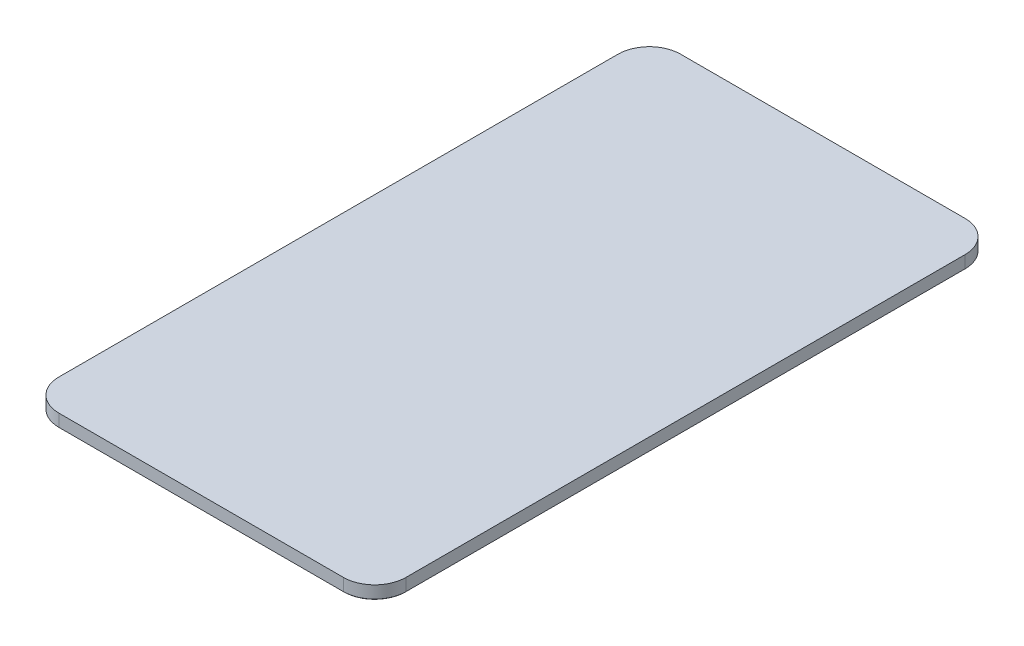
ISO-10303-21;
HEADER;
FILE_DESCRIPTION(('STEP AP214'),'2;1');
FILE_NAME('part.step','',(''),(''),'','','');
FILE_SCHEMA(('AUTOMOTIVE_DESIGN { 1 0 10303 214 1 1 1 1 }'));
ENDSEC;
DATA;
#1=APPLICATION_CONTEXT('core data for automotive mechanical design processes');
#2=APPLICATION_PROTOCOL_DEFINITION('international standard','automotive_design',2000,#1);
#3=PRODUCT_CONTEXT('',#1,'mechanical');
#4=PRODUCT('Part','Part','',(#3));
#5=PRODUCT_RELATED_PRODUCT_CATEGORY('part','',(#4));
#6=PRODUCT_DEFINITION_FORMATION('','',#4);
#7=PRODUCT_DEFINITION_CONTEXT('part definition',#1,'design');
#8=PRODUCT_DEFINITION('design','',#6,#7);
#9=PRODUCT_DEFINITION_SHAPE('','',#8);
#10=(LENGTH_UNIT() NAMED_UNIT(*) SI_UNIT(.MILLI.,.METRE.));
#11=(NAMED_UNIT(*) PLANE_ANGLE_UNIT() SI_UNIT($,.RADIAN.));
#12=(NAMED_UNIT(*) SI_UNIT($,.STERADIAN.) SOLID_ANGLE_UNIT());
#13=UNCERTAINTY_MEASURE_WITH_UNIT(LENGTH_MEASURE(1.E-05),#10,'distance_accuracy_value','');
#14=(GEOMETRIC_REPRESENTATION_CONTEXT(3) GLOBAL_UNCERTAINTY_ASSIGNED_CONTEXT((#13)) GLOBAL_UNIT_ASSIGNED_CONTEXT((#10,
#11,#12)) REPRESENTATION_CONTEXT('',''));
#15=CARTESIAN_POINT('',(0.,0.,0.));
#16=DIRECTION('',(0.,0.,1.));
#17=DIRECTION('',(1.,0.,0.));
#18=AXIS2_PLACEMENT_3D('',#15,#16,#17);
#19=CARTESIAN_POINT('',(0.,5.969,0.));
#20=DIRECTION('',(1.,0.,0.));
#21=DIRECTION('',(0.,0.,-1.));
#22=AXIS2_PLACEMENT_3D('',#19,#20,#21);
#23=PLANE('',#22);
#24=DIRECTION('',(0.,-1.,0.));
#25=VECTOR('',#24,1.);
#26=CARTESIAN_POINT('',(0.,5.969,-273.05));
#27=LINE('',#26,#25);
#28=CARTESIAN_POINT('',(0.,5.969,-273.05));
#29=VERTEX_POINT('',#28);
#30=CARTESIAN_POINT('',(0.,0.254000000000004,-273.05));
#31=VERTEX_POINT('',#30);
#32=EDGE_CURVE('E160',#29,#31,#27,.T.);
#33=ORIENTED_EDGE('',*,*,#32,.T.);
#34=DIRECTION('',(0.,0.,1.));
#35=VECTOR('',#34,1.);
#36=CARTESIAN_POINT('',(0.,0.254000000000004,-14.478));
#37=LINE('',#36,#35);
#38=CARTESIAN_POINT('',(0.,0.254000000000004,-14.478));
#39=VERTEX_POINT('',#38);
#40=EDGE_CURVE('E189',#31,#39,#37,.T.);
#41=ORIENTED_EDGE('',*,*,#40,.T.);
#42=DIRECTION('',(0.,-1.,0.));
#43=VECTOR('',#42,1.);
#44=CARTESIAN_POINT('',(0.,5.969,-14.478));
#45=LINE('',#44,#43);
#46=CARTESIAN_POINT('',(0.,5.969,-14.478));
#47=VERTEX_POINT('',#46);
#48=EDGE_CURVE('E163',#39,#47,#45,.F.);
#49=ORIENTED_EDGE('',*,*,#48,.T.);
#50=DIRECTION('',(0.,0.,1.));
#51=VECTOR('',#50,1.);
#52=CARTESIAN_POINT('',(0.,5.969,0.));
#53=LINE('',#52,#51);
#54=EDGE_CURVE('E218',#29,#47,#53,.T.);
#55=ORIENTED_EDGE('',*,*,#54,.F.);
#56=EDGE_LOOP('',(#33,#41,#49,#55));
#57=FACE_BOUND('',#56,.T.);
#58=ADVANCED_FACE('F35',(#57),#23,.F.);
#59=CARTESIAN_POINT('',(0.,5.969,0.));
#60=DIRECTION('',(0.,0.,-1.));
#61=DIRECTION('',(-1.,0.,0.));
#62=AXIS2_PLACEMENT_3D('',#59,#60,#61);
#63=PLANE('',#62);
#64=DIRECTION('',(0.,-1.,0.));
#65=VECTOR('',#64,1.);
#66=CARTESIAN_POINT('',(14.478,5.969,0.));
#67=LINE('',#66,#65);
#68=CARTESIAN_POINT('',(14.478,5.969,0.));
#69=VERTEX_POINT('',#68);
#70=CARTESIAN_POINT('',(14.478,0.254000000000004,0.));
#71=VERTEX_POINT('',#70);
#72=EDGE_CURVE('E133',#69,#71,#67,.T.);
#73=ORIENTED_EDGE('',*,*,#72,.T.);
#74=DIRECTION('',(1.,0.,0.));
#75=VECTOR('',#74,1.);
#76=CARTESIAN_POINT('',(146.05,0.254000000000004,0.));
#77=LINE('',#76,#75);
#78=CARTESIAN_POINT('',(146.05,0.254000000000004,0.));
#79=VERTEX_POINT('',#78);
#80=EDGE_CURVE('E185',#71,#79,#77,.T.);
#81=ORIENTED_EDGE('',*,*,#80,.T.);
#82=DIRECTION('',(0.,-1.,0.));
#83=VECTOR('',#82,1.);
#84=CARTESIAN_POINT('',(146.05,5.969,0.));
#85=LINE('',#84,#83);
#86=CARTESIAN_POINT('',(146.05,5.969,0.));
#87=VERTEX_POINT('',#86);
#88=EDGE_CURVE('E158',#79,#87,#85,.F.);
#89=ORIENTED_EDGE('',*,*,#88,.T.);
#90=DIRECTION('',(1.,0.,0.));
#91=VECTOR('',#90,1.);
#92=CARTESIAN_POINT('',(0.,5.969,0.));
#93=LINE('',#92,#91);
#94=EDGE_CURVE('E223',#69,#87,#93,.T.);
#95=ORIENTED_EDGE('',*,*,#94,.F.);
#96=EDGE_LOOP('',(#73,#81,#89,#95));
#97=FACE_BOUND('',#96,.T.);
#98=ADVANCED_FACE('F267',(#97),#63,.F.);
#99=CARTESIAN_POINT('',(160.528,5.969,0.));
#100=DIRECTION('',(-1.,0.,0.));
#101=DIRECTION('',(0.,0.,1.));
#102=AXIS2_PLACEMENT_3D('',#99,#100,#101);
#103=PLANE('',#102);
#104=DIRECTION('',(0.,-1.,0.));
#105=VECTOR('',#104,1.);
#106=CARTESIAN_POINT('',(160.528,5.969,-14.478));
#107=LINE('',#106,#105);
#108=CARTESIAN_POINT('',(160.528,5.969,-14.478));
#109=VERTEX_POINT('',#108);
#110=CARTESIAN_POINT('',(160.528,0.254000000000004,-14.478));
#111=VERTEX_POINT('',#110);
#112=EDGE_CURVE('E144',#109,#111,#107,.T.);
#113=ORIENTED_EDGE('',*,*,#112,.T.);
#114=DIRECTION('',(0.,0.,-1.));
#115=VECTOR('',#114,1.);
#116=CARTESIAN_POINT('',(160.528,0.254000000000004,-273.05));
#117=LINE('',#116,#115);
#118=CARTESIAN_POINT('',(160.528,0.254000000000004,-273.05));
#119=VERTEX_POINT('',#118);
#120=EDGE_CURVE('E11',#111,#119,#117,.T.);
#121=ORIENTED_EDGE('',*,*,#120,.T.);
#122=DIRECTION('',(0.,-1.,0.));
#123=VECTOR('',#122,1.);
#124=CARTESIAN_POINT('',(160.528,5.969,-273.05));
#125=LINE('',#124,#123);
#126=CARTESIAN_POINT('',(160.528,5.969,-273.05));
#127=VERTEX_POINT('',#126);
#128=EDGE_CURVE('E146',#119,#127,#125,.F.);
#129=ORIENTED_EDGE('',*,*,#128,.T.);
#130=DIRECTION('',(0.,0.,-1.));
#131=VECTOR('',#130,1.);
#132=CARTESIAN_POINT('',(160.528,5.969,0.));
#133=LINE('',#132,#131);
#134=EDGE_CURVE('E132',#109,#127,#133,.T.);
#135=ORIENTED_EDGE('',*,*,#134,.F.);
#136=EDGE_LOOP('',(#113,#121,#129,#135));
#137=FACE_BOUND('',#136,.T.);
#138=ADVANCED_FACE('F239',(#137),#103,.F.);
#139=CARTESIAN_POINT('',(0.,5.969,-287.528));
#140=DIRECTION('',(0.,0.,1.));
#141=DIRECTION('',(1.,0.,0.));
#142=AXIS2_PLACEMENT_3D('',#139,#140,#141);
#143=PLANE('',#142);
#144=DIRECTION('',(0.,-1.,0.));
#145=VECTOR('',#144,1.);
#146=CARTESIAN_POINT('',(146.05,5.969,-287.528));
#147=LINE('',#146,#145);
#148=CARTESIAN_POINT('',(146.05,5.969,-287.528));
#149=VERTEX_POINT('',#148);
#150=CARTESIAN_POINT('',(146.05,0.254000000000004,-287.528));
#151=VERTEX_POINT('',#150);
#152=EDGE_CURVE('E138',#149,#151,#147,.T.);
#153=ORIENTED_EDGE('',*,*,#152,.T.);
#154=DIRECTION('',(-1.,0.,0.));
#155=VECTOR('',#154,1.);
#156=CARTESIAN_POINT('',(14.478,0.254000000000004,-287.528));
#157=LINE('',#156,#155);
#158=CARTESIAN_POINT('',(14.478,0.254000000000004,-287.528));
#159=VERTEX_POINT('',#158);
#160=EDGE_CURVE('E193',#151,#159,#157,.T.);
#161=ORIENTED_EDGE('',*,*,#160,.T.);
#162=DIRECTION('',(0.,-1.,0.));
#163=VECTOR('',#162,1.);
#164=CARTESIAN_POINT('',(14.478,5.969,-287.528));
#165=LINE('',#164,#163);
#166=CARTESIAN_POINT('',(14.478,5.969,-287.528));
#167=VERTEX_POINT('',#166);
#168=EDGE_CURVE('E141',#159,#167,#165,.F.);
#169=ORIENTED_EDGE('',*,*,#168,.T.);
#170=DIRECTION('',(-1.,0.,0.));
#171=VECTOR('',#170,1.);
#172=CARTESIAN_POINT('',(0.,5.969,-287.528));
#173=LINE('',#172,#171);
#174=EDGE_CURVE('E129',#149,#167,#173,.T.);
#175=ORIENTED_EDGE('',*,*,#174,.F.);
#176=EDGE_LOOP('',(#153,#161,#169,#175));
#177=FACE_BOUND('',#176,.T.);
#178=ADVANCED_FACE('F137',(#177),#143,.F.);
#179=CARTESIAN_POINT('',(0.,5.969,0.));
#180=DIRECTION('',(0.,-1.,0.));
#181=DIRECTION('',(0.,0.,-1.));
#182=AXIS2_PLACEMENT_3D('',#179,#180,#181);
#183=PLANE('',#182);
#184=ORIENTED_EDGE('',*,*,#134,.T.);
#185=CARTESIAN_POINT('',(146.05,5.969,-273.05));
#186=DIRECTION('',(0.,-1.,0.));
#187=DIRECTION('',(0.,0.,-1.));
#188=AXIS2_PLACEMENT_3D('',#185,#186,#187);
#189=CIRCLE('',#188,14.478);
#190=EDGE_CURVE('E126',#127,#149,#189,.F.);
#191=ORIENTED_EDGE('',*,*,#190,.T.);
#192=ORIENTED_EDGE('',*,*,#174,.T.);
#193=CARTESIAN_POINT('',(14.478,5.969,-273.05));
#194=DIRECTION('',(0.,-1.,0.));
#195=DIRECTION('',(0.,0.,-1.));
#196=AXIS2_PLACEMENT_3D('',#193,#194,#195);
#197=CIRCLE('',#196,14.478);
#198=EDGE_CURVE('E151',#167,#29,#197,.F.);
#199=ORIENTED_EDGE('',*,*,#198,.T.);
#200=ORIENTED_EDGE('',*,*,#54,.T.);
#201=CARTESIAN_POINT('',(14.478,5.969,-14.478));
#202=DIRECTION('',(0.,-1.,0.));
#203=DIRECTION('',(0.,0.,-1.));
#204=AXIS2_PLACEMENT_3D('',#201,#202,#203);
#205=CIRCLE('',#204,14.478);
#206=EDGE_CURVE('E153',#47,#69,#205,.F.);
#207=ORIENTED_EDGE('',*,*,#206,.T.);
#208=ORIENTED_EDGE('',*,*,#94,.T.);
#209=CARTESIAN_POINT('',(146.05,5.969,-14.478));
#210=DIRECTION('',(0.,-1.,0.));
#211=DIRECTION('',(0.,0.,-1.));
#212=AXIS2_PLACEMENT_3D('',#209,#210,#211);
#213=CIRCLE('',#212,14.478);
#214=EDGE_CURVE('E134',#87,#109,#213,.F.);
#215=ORIENTED_EDGE('',*,*,#214,.T.);
#216=EDGE_LOOP('',(#184,#191,#192,#199,#200,#207,#208,#215));
#217=FACE_BOUND('',#216,.T.);
#218=ADVANCED_FACE('F128',(#217),#183,.F.);
#219=CARTESIAN_POINT('',(0.,0.,0.));
#220=DIRECTION('',(0.,-1.,0.));
#221=DIRECTION('',(0.,0.,-1.));
#222=AXIS2_PLACEMENT_3D('',#219,#220,#221);
#223=PLANE('',#222);
#224=DIRECTION('',(0.,0.,1.));
#225=VECTOR('',#224,1.);
#226=CARTESIAN_POINT('',(160.274,0.,-14.478));
#227=LINE('',#226,#225);
#228=CARTESIAN_POINT('',(160.274,0.,-273.05));
#229=VERTEX_POINT('',#228);
#230=CARTESIAN_POINT('',(160.274,0.,-14.478));
#231=VERTEX_POINT('',#230);
#232=EDGE_CURVE('E165',#229,#231,#227,.T.);
#233=ORIENTED_EDGE('',*,*,#232,.T.);
#234=CARTESIAN_POINT('',(146.05,0.,-14.478));
#235=DIRECTION('',(0.,-1.,0.));
#236=DIRECTION('',(0.,0.,-1.));
#237=AXIS2_PLACEMENT_3D('',#234,#235,#236);
#238=CIRCLE('',#237,14.224);
#239=CARTESIAN_POINT('',(146.05,0.,-0.254000000000004));
#240=VERTEX_POINT('',#239);
#241=EDGE_CURVE('E179',#231,#240,#238,.T.);
#242=ORIENTED_EDGE('',*,*,#241,.T.);
#243=DIRECTION('',(-1.,0.,0.));
#244=VECTOR('',#243,1.);
#245=CARTESIAN_POINT('',(14.478,0.,-0.254000000000004));
#246=LINE('',#245,#244);
#247=CARTESIAN_POINT('',(14.478,0.,-0.254000000000004));
#248=VERTEX_POINT('',#247);
#249=EDGE_CURVE('E177',#240,#248,#246,.T.);
#250=ORIENTED_EDGE('',*,*,#249,.T.);
#251=CARTESIAN_POINT('',(14.478,0.,-14.478));
#252=DIRECTION('',(0.,-1.,0.));
#253=DIRECTION('',(0.,0.,-1.));
#254=AXIS2_PLACEMENT_3D('',#251,#252,#253);
#255=CIRCLE('',#254,14.224);
#256=CARTESIAN_POINT('',(0.254000000000004,0.,-14.478));
#257=VERTEX_POINT('',#256);
#258=EDGE_CURVE('E175',#248,#257,#255,.T.);
#259=ORIENTED_EDGE('',*,*,#258,.T.);
#260=DIRECTION('',(0.,0.,-1.));
#261=VECTOR('',#260,1.);
#262=CARTESIAN_POINT('',(0.254000000000004,0.,-273.05));
#263=LINE('',#262,#261);
#264=CARTESIAN_POINT('',(0.253999999999983,0.,-273.05));
#265=VERTEX_POINT('',#264);
#266=EDGE_CURVE('E173',#257,#265,#263,.T.);
#267=ORIENTED_EDGE('',*,*,#266,.T.);
#268=CARTESIAN_POINT('',(14.478,0.,-273.05));
#269=DIRECTION('',(0.,-1.,0.));
#270=DIRECTION('',(0.,0.,-1.));
#271=AXIS2_PLACEMENT_3D('',#268,#269,#270);
#272=CIRCLE('',#271,14.224);
#273=CARTESIAN_POINT('',(14.478,0.,-287.274));
#274=VERTEX_POINT('',#273);
#275=EDGE_CURVE('E171',#265,#274,#272,.T.);
#276=ORIENTED_EDGE('',*,*,#275,.T.);
#277=DIRECTION('',(1.,0.,0.));
#278=VECTOR('',#277,1.);
#279=CARTESIAN_POINT('',(146.05,0.,-287.274));
#280=LINE('',#279,#278);
#281=CARTESIAN_POINT('',(146.05,0.,-287.274));
#282=VERTEX_POINT('',#281);
#283=EDGE_CURVE('E169',#274,#282,#280,.T.);
#284=ORIENTED_EDGE('',*,*,#283,.T.);
#285=CARTESIAN_POINT('',(146.05,0.,-273.05));
#286=DIRECTION('',(0.,-1.,0.));
#287=DIRECTION('',(0.,0.,-1.));
#288=AXIS2_PLACEMENT_3D('',#285,#286,#287);
#289=CIRCLE('',#288,14.224);
#290=EDGE_CURVE('E167',#282,#229,#289,.T.);
#291=ORIENTED_EDGE('',*,*,#290,.T.);
#292=EDGE_LOOP('',(#233,#242,#250,#259,#267,#276,#284,#291));
#293=FACE_BOUND('',#292,.T.);
#294=ADVANCED_FACE('F251',(#293),#223,.T.);
#295=CARTESIAN_POINT('',(146.05,5.969,-273.05));
#296=DIRECTION('',(0.,-1.,0.));
#297=DIRECTION('',(0.,0.,-1.));
#298=AXIS2_PLACEMENT_3D('',#295,#296,#297);
#299=CYLINDRICAL_SURFACE('',#298,14.478);
#300=ORIENTED_EDGE('',*,*,#128,.F.);
#301=CARTESIAN_POINT('',(146.05,0.254000000000004,-273.05));
#302=DIRECTION('',(0.,-1.,0.));
#303=DIRECTION('',(0.,0.,-1.));
#304=AXIS2_PLACEMENT_3D('',#301,#302,#303);
#305=CIRCLE('',#304,14.478);
#306=EDGE_CURVE('E44',#119,#151,#305,.F.);
#307=ORIENTED_EDGE('',*,*,#306,.T.);
#308=ORIENTED_EDGE('',*,*,#152,.F.);
#309=ORIENTED_EDGE('',*,*,#190,.F.);
#310=EDGE_LOOP('',(#300,#307,#308,#309));
#311=FACE_BOUND('',#310,.T.);
#312=ADVANCED_FACE('F143',(#311),#299,.T.);
#313=CARTESIAN_POINT('',(146.05,5.969,-14.478));
#314=DIRECTION('',(0.,-1.,0.));
#315=DIRECTION('',(0.,0.,-1.));
#316=AXIS2_PLACEMENT_3D('',#313,#314,#315);
#317=CYLINDRICAL_SURFACE('',#316,14.478);
#318=ORIENTED_EDGE('',*,*,#88,.F.);
#319=CARTESIAN_POINT('',(146.05,0.254000000000004,-14.478));
#320=DIRECTION('',(0.,-1.,0.));
#321=DIRECTION('',(0.,0.,-1.));
#322=AXIS2_PLACEMENT_3D('',#319,#320,#321);
#323=CIRCLE('',#322,14.478);
#324=EDGE_CURVE('E182',#79,#111,#323,.F.);
#325=ORIENTED_EDGE('',*,*,#324,.T.);
#326=ORIENTED_EDGE('',*,*,#112,.F.);
#327=ORIENTED_EDGE('',*,*,#214,.F.);
#328=EDGE_LOOP('',(#318,#325,#326,#327));
#329=FACE_BOUND('',#328,.T.);
#330=ADVANCED_FACE('F237',(#329),#317,.T.);
#331=CARTESIAN_POINT('',(14.478,5.969,-14.478));
#332=DIRECTION('',(0.,-1.,0.));
#333=DIRECTION('',(0.,0.,-1.));
#334=AXIS2_PLACEMENT_3D('',#331,#332,#333);
#335=CYLINDRICAL_SURFACE('',#334,14.478);
#336=ORIENTED_EDGE('',*,*,#48,.F.);
#337=CARTESIAN_POINT('',(14.478,0.254000000000004,-14.478));
#338=DIRECTION('',(0.,-1.,0.));
#339=DIRECTION('',(0.,0.,-1.));
#340=AXIS2_PLACEMENT_3D('',#337,#338,#339);
#341=CIRCLE('',#340,14.478);
#342=EDGE_CURVE('E187',#39,#71,#341,.F.);
#343=ORIENTED_EDGE('',*,*,#342,.T.);
#344=ORIENTED_EDGE('',*,*,#72,.F.);
#345=ORIENTED_EDGE('',*,*,#206,.F.);
#346=EDGE_LOOP('',(#336,#343,#344,#345));
#347=FACE_BOUND('',#346,.T.);
#348=ADVANCED_FACE('F265',(#347),#335,.T.);
#349=CARTESIAN_POINT('',(14.478,5.969,-273.05));
#350=DIRECTION('',(0.,-1.,0.));
#351=DIRECTION('',(0.,0.,-1.));
#352=AXIS2_PLACEMENT_3D('',#349,#350,#351);
#353=CYLINDRICAL_SURFACE('',#352,14.478);
#354=ORIENTED_EDGE('',*,*,#168,.F.);
#355=CARTESIAN_POINT('',(14.478,0.254000000000004,-273.05));
#356=DIRECTION('',(0.,-1.,0.));
#357=DIRECTION('',(0.,0.,-1.));
#358=AXIS2_PLACEMENT_3D('',#355,#356,#357);
#359=CIRCLE('',#358,14.478);
#360=EDGE_CURVE('E191',#159,#31,#359,.F.);
#361=ORIENTED_EDGE('',*,*,#360,.T.);
#362=ORIENTED_EDGE('',*,*,#32,.F.);
#363=ORIENTED_EDGE('',*,*,#198,.F.);
#364=EDGE_LOOP('',(#354,#361,#362,#363));
#365=FACE_BOUND('',#364,.T.);
#366=ADVANCED_FACE('F256',(#365),#353,.T.);
#367=CARTESIAN_POINT('',(14.478,0.,-273.05));
#368=DIRECTION('',(0.,1.,0.));
#369=DIRECTION('',(0.,0.,1.));
#370=AXIS2_PLACEMENT_3D('',#367,#368,#369);
#371=CONICAL_SURFACE('',#370,14.224,0.785398163397448);
#372=DIRECTION('',(0.707106781186518,-0.707106781186576,0.));
#373=VECTOR('',#372,1.);
#374=CARTESIAN_POINT('',(0.,0.254000000000004,-273.05));
#375=LINE('',#374,#373);
#376=EDGE_CURVE('E211',#31,#265,#375,.T.);
#377=ORIENTED_EDGE('',*,*,#376,.F.);
#378=ORIENTED_EDGE('',*,*,#360,.F.);
#379=DIRECTION('',(0.,0.707106781186586,-0.707106781186509));
#380=VECTOR('',#379,1.);
#381=CARTESIAN_POINT('',(14.478,0.,-287.274));
#382=LINE('',#381,#380);
#383=EDGE_CURVE('E39',#274,#159,#382,.T.);
#384=ORIENTED_EDGE('',*,*,#383,.F.);
#385=ORIENTED_EDGE('',*,*,#275,.F.);
#386=EDGE_LOOP('',(#377,#378,#384,#385));
#387=FACE_BOUND('',#386,.T.);
#388=ADVANCED_FACE('F37',(#387),#371,.T.);
#389=CARTESIAN_POINT('',(0.,0.254000000000004,-287.528));
#390=DIRECTION('',(0.,-0.707106781186509,-0.707106781186586));
#391=DIRECTION('',(1.,0.,0.));
#392=AXIS2_PLACEMENT_3D('',#389,#390,#391);
#393=PLANE('',#392);
#394=ORIENTED_EDGE('',*,*,#383,.T.);
#395=ORIENTED_EDGE('',*,*,#160,.F.);
#396=DIRECTION('',(0.,0.707106781186586,-0.707106781186509));
#397=VECTOR('',#396,1.);
#398=CARTESIAN_POINT('',(146.05,0.,-287.274));
#399=LINE('',#398,#397);
#400=EDGE_CURVE('E209',#282,#151,#399,.T.);
#401=ORIENTED_EDGE('',*,*,#400,.F.);
#402=ORIENTED_EDGE('',*,*,#283,.F.);
#403=EDGE_LOOP('',(#394,#395,#401,#402));
#404=FACE_BOUND('',#403,.T.);
#405=ADVANCED_FACE('F253',(#404),#393,.T.);
#406=CARTESIAN_POINT('',(0.,0.254000000000004,0.));
#407=DIRECTION('',(-0.707106781186547,-0.707106781186547,0.));
#408=DIRECTION('',(0.,0.,-1.));
#409=AXIS2_PLACEMENT_3D('',#406,#407,#408);
#410=PLANE('',#409);
#411=ORIENTED_EDGE('',*,*,#376,.T.);
#412=ORIENTED_EDGE('',*,*,#266,.F.);
#413=DIRECTION('',(0.707106781186547,-0.707106781186547,0.));
#414=VECTOR('',#413,1.);
#415=CARTESIAN_POINT('',(0.,0.254000000000004,-14.478));
#416=LINE('',#415,#414);
#417=EDGE_CURVE('E206',#39,#257,#416,.T.);
#418=ORIENTED_EDGE('',*,*,#417,.F.);
#419=ORIENTED_EDGE('',*,*,#40,.F.);
#420=EDGE_LOOP('',(#411,#412,#418,#419));
#421=FACE_BOUND('',#420,.T.);
#422=ADVANCED_FACE('F260',(#421),#410,.T.);
#423=CARTESIAN_POINT('',(146.05,0.,-273.05));
#424=DIRECTION('',(0.,1.,0.));
#425=DIRECTION('',(0.,0.,1.));
#426=AXIS2_PLACEMENT_3D('',#423,#424,#425);
#427=CONICAL_SURFACE('',#426,14.224,0.785398163397407);
#428=ORIENTED_EDGE('',*,*,#400,.T.);
#429=ORIENTED_EDGE('',*,*,#306,.F.);
#430=DIRECTION('',(0.707106781186509,0.707106781186586,0.));
#431=VECTOR('',#430,1.);
#432=CARTESIAN_POINT('',(160.274,0.,-273.05));
#433=LINE('',#432,#431);
#434=EDGE_CURVE('E203',#229,#119,#433,.T.);
#435=ORIENTED_EDGE('',*,*,#434,.F.);
#436=ORIENTED_EDGE('',*,*,#290,.F.);
#437=EDGE_LOOP('',(#428,#429,#435,#436));
#438=FACE_BOUND('',#437,.T.);
#439=ADVANCED_FACE('F242',(#438),#427,.T.);
#440=CARTESIAN_POINT('',(14.478,0.,-14.478));
#441=DIRECTION('',(0.,1.,0.));
#442=DIRECTION('',(0.,0.,1.));
#443=AXIS2_PLACEMENT_3D('',#440,#441,#442);
#444=CONICAL_SURFACE('',#443,14.224,0.785398163397448);
#445=ORIENTED_EDGE('',*,*,#417,.T.);
#446=ORIENTED_EDGE('',*,*,#258,.F.);
#447=DIRECTION('',(0.,-0.707106781186547,-0.707106781186547));
#448=VECTOR('',#447,1.);
#449=CARTESIAN_POINT('',(14.478,0.254000000000004,0.));
#450=LINE('',#449,#448);
#451=EDGE_CURVE('E200',#71,#248,#450,.T.);
#452=ORIENTED_EDGE('',*,*,#451,.F.);
#453=ORIENTED_EDGE('',*,*,#342,.F.);
#454=EDGE_LOOP('',(#445,#446,#452,#453));
#455=FACE_BOUND('',#454,.T.);
#456=ADVANCED_FACE('F271',(#455),#444,.T.);
#457=CARTESIAN_POINT('',(160.528,0.254000000000004,0.));
#458=DIRECTION('',(0.707106781186547,-0.707106781186547,0.));
#459=DIRECTION('',(0.,0.,1.));
#460=AXIS2_PLACEMENT_3D('',#457,#458,#459);
#461=PLANE('',#460);
#462=ORIENTED_EDGE('',*,*,#434,.T.);
#463=ORIENTED_EDGE('',*,*,#120,.F.);
#464=DIRECTION('',(0.707106781186547,0.707106781186547,0.));
#465=VECTOR('',#464,1.);
#466=CARTESIAN_POINT('',(160.274,0.,-14.478));
#467=LINE('',#466,#465);
#468=EDGE_CURVE('E198',#231,#111,#467,.T.);
#469=ORIENTED_EDGE('',*,*,#468,.F.);
#470=ORIENTED_EDGE('',*,*,#232,.F.);
#471=EDGE_LOOP('',(#462,#463,#469,#470));
#472=FACE_BOUND('',#471,.T.);
#473=ADVANCED_FACE('F247',(#472),#461,.T.);
#474=CARTESIAN_POINT('',(0.,0.254000000000004,0.));
#475=DIRECTION('',(0.,-0.707106781186547,0.707106781186547));
#476=DIRECTION('',(-1.,0.,0.));
#477=AXIS2_PLACEMENT_3D('',#474,#475,#476);
#478=PLANE('',#477);
#479=ORIENTED_EDGE('',*,*,#451,.T.);
#480=ORIENTED_EDGE('',*,*,#249,.F.);
#481=DIRECTION('',(0.,-0.707106781186547,-0.707106781186547));
#482=VECTOR('',#481,1.);
#483=CARTESIAN_POINT('',(146.05,0.254000000000004,0.));
#484=LINE('',#483,#482);
#485=EDGE_CURVE('E196',#79,#240,#484,.T.);
#486=ORIENTED_EDGE('',*,*,#485,.F.);
#487=ORIENTED_EDGE('',*,*,#80,.F.);
#488=EDGE_LOOP('',(#479,#480,#486,#487));
#489=FACE_BOUND('',#488,.T.);
#490=ADVANCED_FACE('F275',(#489),#478,.T.);
#491=CARTESIAN_POINT('',(146.05,0.,-14.478));
#492=DIRECTION('',(0.,1.,0.));
#493=DIRECTION('',(0.,0.,1.));
#494=AXIS2_PLACEMENT_3D('',#491,#492,#493);
#495=CONICAL_SURFACE('',#494,14.224,0.785398163397462);
#496=ORIENTED_EDGE('',*,*,#468,.T.);
#497=ORIENTED_EDGE('',*,*,#324,.F.);
#498=ORIENTED_EDGE('',*,*,#485,.T.);
#499=ORIENTED_EDGE('',*,*,#241,.F.);
#500=EDGE_LOOP('',(#496,#497,#498,#499));
#501=FACE_BOUND('',#500,.T.);
#502=ADVANCED_FACE('F277',(#501),#495,.T.);
#503=CLOSED_SHELL('',(#58,#98,#138,#178,#218,#294,#312,#330,#348,#366,#388,#405,#422,#439,#456,
#473,#490,#502));
#504=MANIFOLD_SOLID_BREP('B2',#503);
#505=ADVANCED_BREP_SHAPE_REPRESENTATION('',(#18,#504),#14);
#506=SHAPE_DEFINITION_REPRESENTATION(#9,#505);
ENDSEC;
END-ISO-10303-21;
